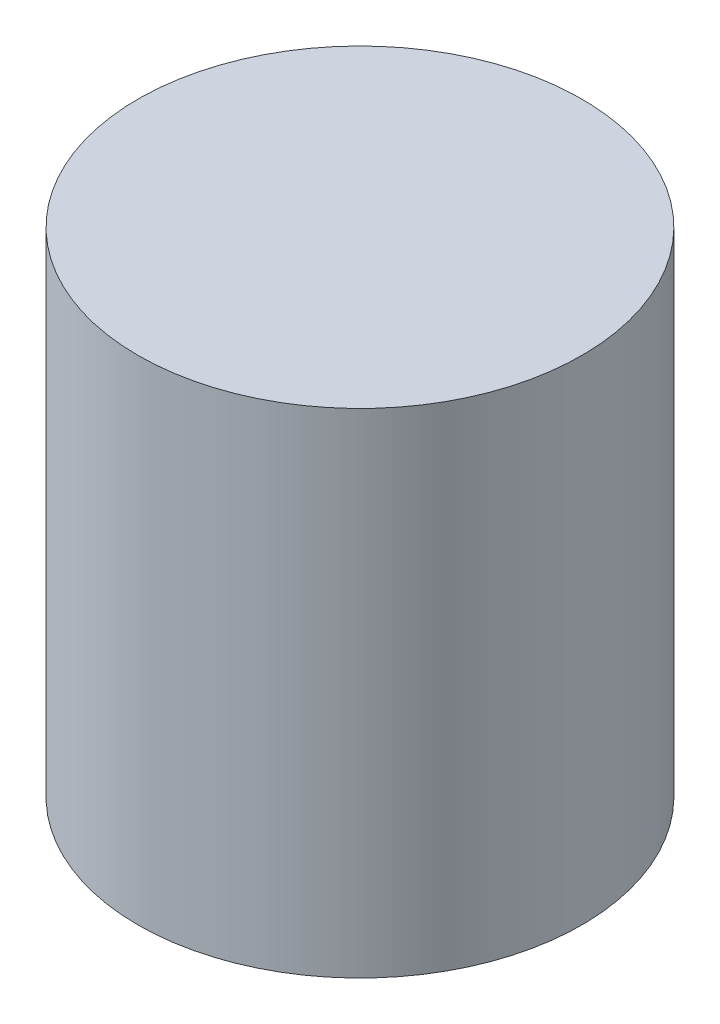
ISO-10303-21;
HEADER;
FILE_DESCRIPTION(('STEP AP214'),'2;1');
FILE_NAME('part.step','',(''),(''),'','','');
FILE_SCHEMA(('AUTOMOTIVE_DESIGN { 1 0 10303 214 1 1 1 1 }'));
ENDSEC;
DATA;
#1=APPLICATION_CONTEXT('core data for automotive mechanical design processes');
#2=APPLICATION_PROTOCOL_DEFINITION('international standard','automotive_design',2000,#1);
#3=PRODUCT_CONTEXT('',#1,'mechanical');
#4=PRODUCT('Part','Part','',(#3));
#5=PRODUCT_RELATED_PRODUCT_CATEGORY('part','',(#4));
#6=PRODUCT_DEFINITION_FORMATION('','',#4);
#7=PRODUCT_DEFINITION_CONTEXT('part definition',#1,'design');
#8=PRODUCT_DEFINITION('design','',#6,#7);
#9=PRODUCT_DEFINITION_SHAPE('','',#8);
#10=(LENGTH_UNIT() NAMED_UNIT(*) SI_UNIT(.MILLI.,.METRE.));
#11=(NAMED_UNIT(*) PLANE_ANGLE_UNIT() SI_UNIT($,.RADIAN.));
#12=(NAMED_UNIT(*) SI_UNIT($,.STERADIAN.) SOLID_ANGLE_UNIT());
#13=UNCERTAINTY_MEASURE_WITH_UNIT(LENGTH_MEASURE(1.E-05),#10,'distance_accuracy_value','');
#14=(GEOMETRIC_REPRESENTATION_CONTEXT(3) GLOBAL_UNCERTAINTY_ASSIGNED_CONTEXT((#13)) GLOBAL_UNIT_ASSIGNED_CONTEXT((#10,
#11,#12)) REPRESENTATION_CONTEXT('',''));
#15=CARTESIAN_POINT('',(0.,0.,0.));
#16=DIRECTION('',(0.,0.,1.));
#17=DIRECTION('',(1.,0.,0.));
#18=AXIS2_PLACEMENT_3D('',#15,#16,#17);
#19=CARTESIAN_POINT('',(0.,5.,0.));
#20=DIRECTION('',(0.,-1.,0.));
#21=DIRECTION('',(0.,0.,-1.));
#22=AXIS2_PLACEMENT_3D('',#19,#20,#21);
#23=CYLINDRICAL_SURFACE('',#22,2.25);
#24=CARTESIAN_POINT('',(0.,5.,0.));
#25=DIRECTION('',(0.,1.,0.));
#26=DIRECTION('',(0.,0.,1.));
#27=AXIS2_PLACEMENT_3D('',#24,#25,#26);
#28=CIRCLE('',#27,2.25);
#29=CARTESIAN_POINT('',(0.,5.,2.25));
#30=VERTEX_POINT('',#29);
#31=EDGE_CURVE('E10',#30,#30,#28,.T.);
#32=ORIENTED_EDGE('',*,*,#31,.F.);
#33=EDGE_LOOP('',(#32));
#34=FACE_BOUND('',#33,.T.);
#35=CARTESIAN_POINT('',(0.,0.,0.));
#36=DIRECTION('',(0.,1.,0.));
#37=DIRECTION('',(0.,0.,1.));
#38=AXIS2_PLACEMENT_3D('',#35,#36,#37);
#39=CIRCLE('',#38,2.25);
#40=CARTESIAN_POINT('',(0.,0.,2.25));
#41=VERTEX_POINT('',#40);
#42=EDGE_CURVE('E34',#41,#41,#39,.T.);
#43=ORIENTED_EDGE('',*,*,#42,.T.);
#44=EDGE_LOOP('',(#43));
#45=FACE_BOUND('',#44,.T.);
#46=ADVANCED_FACE('F31',(#34,#45),#23,.T.);
#47=CARTESIAN_POINT('',(0.,5.,0.));
#48=DIRECTION('',(0.,1.,0.));
#49=DIRECTION('',(0.,0.,1.));
#50=AXIS2_PLACEMENT_3D('',#47,#48,#49);
#51=PLANE('',#50);
#52=ORIENTED_EDGE('',*,*,#31,.T.);
#53=EDGE_LOOP('',(#52));
#54=FACE_BOUND('',#53,.T.);
#55=ADVANCED_FACE('F46',(#54),#51,.T.);
#56=CARTESIAN_POINT('',(0.,0.,0.));
#57=DIRECTION('',(0.,1.,0.));
#58=DIRECTION('',(0.,0.,1.));
#59=AXIS2_PLACEMENT_3D('',#56,#57,#58);
#60=PLANE('',#59);
#61=ORIENTED_EDGE('',*,*,#42,.F.);
#62=EDGE_LOOP('',(#61));
#63=FACE_BOUND('',#62,.T.);
#64=ADVANCED_FACE('F44',(#63),#60,.F.);
#65=CLOSED_SHELL('',(#46,#55,#64));
#66=MANIFOLD_SOLID_BREP('B2',#65);
#67=ADVANCED_BREP_SHAPE_REPRESENTATION('',(#18,#66),#14);
#68=SHAPE_DEFINITION_REPRESENTATION(#9,#67);
ENDSEC;
END-ISO-10303-21;
